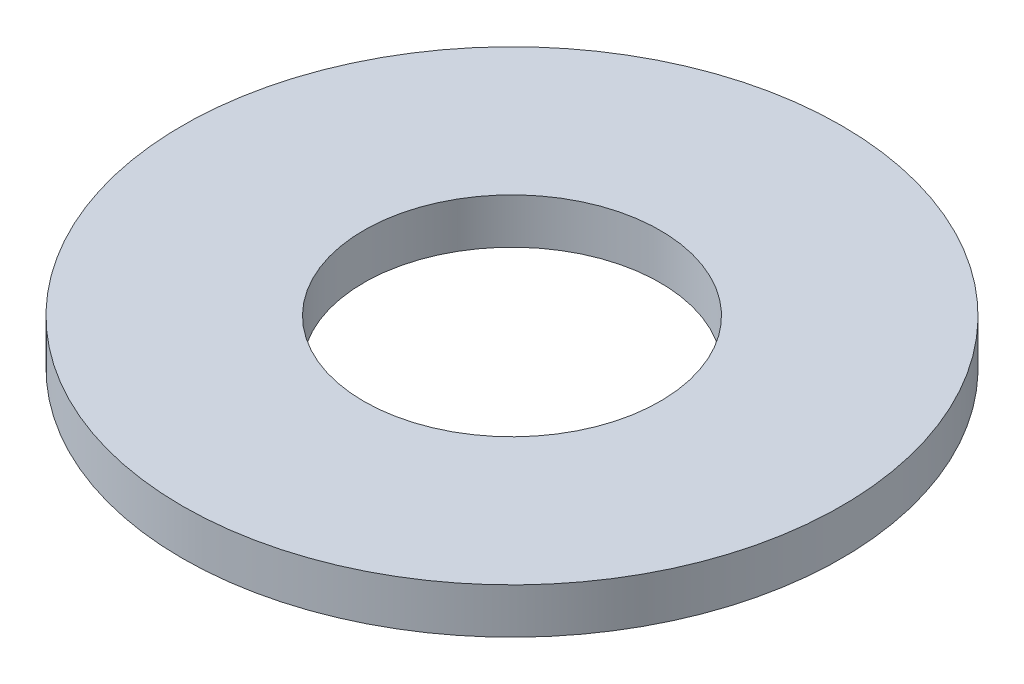
ISO-10303-21;
HEADER;
FILE_DESCRIPTION(('STEP AP214'),'2;1');
FILE_NAME('part.step','',(''),(''),'','','');
FILE_SCHEMA(('AUTOMOTIVE_DESIGN { 1 0 10303 214 1 1 1 1 }'));
ENDSEC;
DATA;
#1=APPLICATION_CONTEXT('core data for automotive mechanical design processes');
#2=APPLICATION_PROTOCOL_DEFINITION('international standard','automotive_design',2000,#1);
#3=PRODUCT_CONTEXT('',#1,'mechanical');
#4=PRODUCT('Part','Part','',(#3));
#5=PRODUCT_RELATED_PRODUCT_CATEGORY('part','',(#4));
#6=PRODUCT_DEFINITION_FORMATION('','',#4);
#7=PRODUCT_DEFINITION_CONTEXT('part definition',#1,'design');
#8=PRODUCT_DEFINITION('design','',#6,#7);
#9=PRODUCT_DEFINITION_SHAPE('','',#8);
#10=(LENGTH_UNIT() NAMED_UNIT(*) SI_UNIT(.MILLI.,.METRE.));
#11=(NAMED_UNIT(*) PLANE_ANGLE_UNIT() SI_UNIT($,.RADIAN.));
#12=(NAMED_UNIT(*) SI_UNIT($,.STERADIAN.) SOLID_ANGLE_UNIT());
#13=UNCERTAINTY_MEASURE_WITH_UNIT(LENGTH_MEASURE(1.E-05),#10,'distance_accuracy_value','');
#14=(GEOMETRIC_REPRESENTATION_CONTEXT(3) GLOBAL_UNCERTAINTY_ASSIGNED_CONTEXT((#13)) GLOBAL_UNIT_ASSIGNED_CONTEXT((#10,
#11,#12)) REPRESENTATION_CONTEXT('',''));
#15=CARTESIAN_POINT('',(0.,0.,0.));
#16=DIRECTION('',(0.,0.,1.));
#17=DIRECTION('',(1.,0.,0.));
#18=AXIS2_PLACEMENT_3D('',#15,#16,#17);
#19=CARTESIAN_POINT('',(0.,1.0922,0.));
#20=DIRECTION('',(0.,-1.,0.));
#21=DIRECTION('',(0.,0.,-1.));
#22=AXIS2_PLACEMENT_3D('',#19,#20,#21);
#23=CYLINDRICAL_SURFACE('',#22,7.9375);
#24=CARTESIAN_POINT('',(0.,1.0922,0.));
#25=DIRECTION('',(0.,1.,0.));
#26=DIRECTION('',(0.,0.,1.));
#27=AXIS2_PLACEMENT_3D('',#24,#25,#26);
#28=CIRCLE('',#27,7.9375);
#29=CARTESIAN_POINT('',(0.,1.0922,7.9375));
#30=VERTEX_POINT('',#29);
#31=EDGE_CURVE('E10',#30,#30,#28,.T.);
#32=ORIENTED_EDGE('',*,*,#31,.F.);
#33=EDGE_LOOP('',(#32));
#34=FACE_BOUND('',#33,.T.);
#35=CARTESIAN_POINT('',(0.,0.,0.));
#36=DIRECTION('',(0.,1.,0.));
#37=DIRECTION('',(0.,0.,1.));
#38=AXIS2_PLACEMENT_3D('',#35,#36,#37);
#39=CIRCLE('',#38,7.9375);
#40=CARTESIAN_POINT('',(0.,0.,7.9375));
#41=VERTEX_POINT('',#40);
#42=EDGE_CURVE('E33',#41,#41,#39,.T.);
#43=ORIENTED_EDGE('',*,*,#42,.T.);
#44=EDGE_LOOP('',(#43));
#45=FACE_BOUND('',#44,.T.);
#46=ADVANCED_FACE('F30',(#34,#45),#23,.T.);
#47=CARTESIAN_POINT('',(0.,1.0922,0.));
#48=DIRECTION('',(0.,1.,0.));
#49=DIRECTION('',(0.,0.,1.));
#50=AXIS2_PLACEMENT_3D('',#47,#48,#49);
#51=PLANE('',#50);
#52=CARTESIAN_POINT('',(0.,1.0922,0.));
#53=DIRECTION('',(0.,1.,0.));
#54=DIRECTION('',(0.,0.,1.));
#55=AXIS2_PLACEMENT_3D('',#52,#53,#54);
#56=CIRCLE('',#55,3.5687);
#57=CARTESIAN_POINT('',(0.,1.0922,3.5687));
#58=VERTEX_POINT('',#57);
#59=EDGE_CURVE('E42',#58,#58,#56,.T.);
#60=ORIENTED_EDGE('',*,*,#59,.F.);
#61=EDGE_LOOP('',(#60));
#62=FACE_BOUND('',#61,.T.);
#63=ORIENTED_EDGE('',*,*,#31,.T.);
#64=EDGE_LOOP('',(#63));
#65=FACE_BOUND('',#64,.T.);
#66=ADVANCED_FACE('F57',(#62,#65),#51,.T.);
#67=CARTESIAN_POINT('',(0.,0.,0.));
#68=DIRECTION('',(0.,1.,0.));
#69=DIRECTION('',(0.,0.,1.));
#70=AXIS2_PLACEMENT_3D('',#67,#68,#69);
#71=PLANE('',#70);
#72=CARTESIAN_POINT('',(0.,0.,0.));
#73=DIRECTION('',(0.,1.,0.));
#74=DIRECTION('',(0.,0.,1.));
#75=AXIS2_PLACEMENT_3D('',#72,#73,#74);
#76=CIRCLE('',#75,3.5687);
#77=CARTESIAN_POINT('',(0.,0.,3.5687));
#78=VERTEX_POINT('',#77);
#79=EDGE_CURVE('E40',#78,#78,#76,.T.);
#80=ORIENTED_EDGE('',*,*,#79,.T.);
#81=EDGE_LOOP('',(#80));
#82=FACE_BOUND('',#81,.T.);
#83=ORIENTED_EDGE('',*,*,#42,.F.);
#84=EDGE_LOOP('',(#83));
#85=FACE_BOUND('',#84,.T.);
#86=ADVANCED_FACE('F48',(#82,#85),#71,.F.);
#87=CARTESIAN_POINT('',(0.,0.,0.));
#88=DIRECTION('',(0.,1.,0.));
#89=DIRECTION('',(0.,0.,1.));
#90=AXIS2_PLACEMENT_3D('',#87,#88,#89);
#91=CYLINDRICAL_SURFACE('',#90,3.5687);
#92=ORIENTED_EDGE('',*,*,#79,.F.);
#93=EDGE_LOOP('',(#92));
#94=FACE_BOUND('',#93,.T.);
#95=ORIENTED_EDGE('',*,*,#59,.T.);
#96=EDGE_LOOP('',(#95));
#97=FACE_BOUND('',#96,.T.);
#98=ADVANCED_FACE('F51',(#94,#97),#91,.F.);
#99=CLOSED_SHELL('',(#46,#66,#86,#98));
#100=MANIFOLD_SOLID_BREP('B2',#99);
#101=ADVANCED_BREP_SHAPE_REPRESENTATION('',(#18,#100),#14);
#102=SHAPE_DEFINITION_REPRESENTATION(#9,#101);
ENDSEC;
END-ISO-10303-21;
